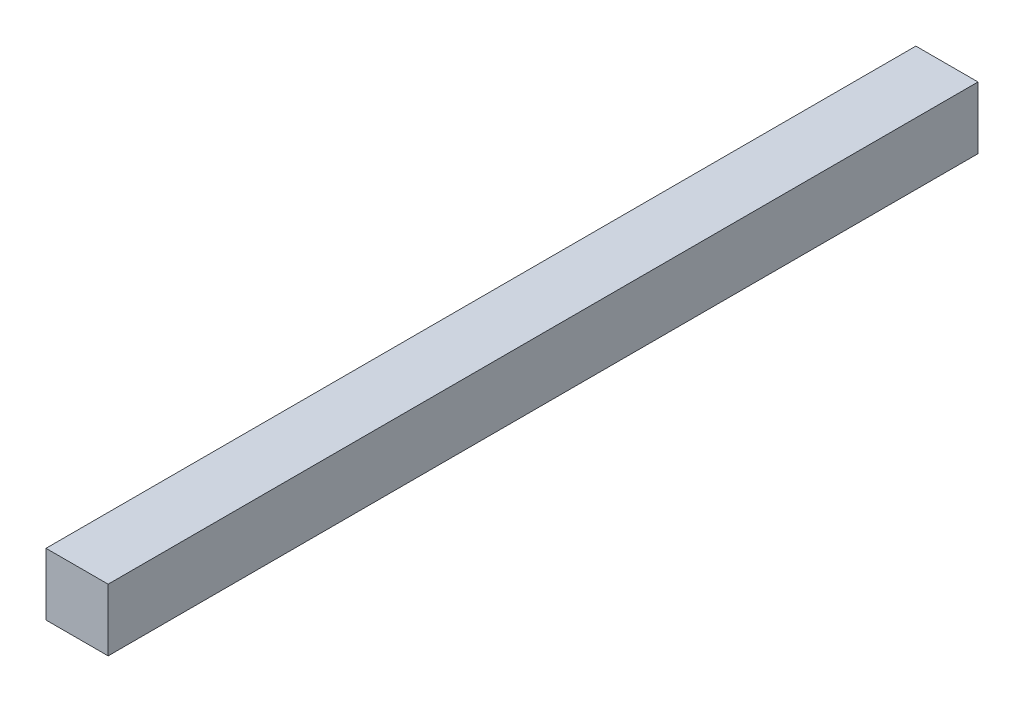
ISO-10303-21;
HEADER;
FILE_DESCRIPTION(('STEP AP214'),'2;1');
FILE_NAME('part.step','',(''),(''),'','','');
FILE_SCHEMA(('AUTOMOTIVE_DESIGN { 1 0 10303 214 1 1 1 1 }'));
ENDSEC;
DATA;
#1=APPLICATION_CONTEXT('core data for automotive mechanical design processes');
#2=APPLICATION_PROTOCOL_DEFINITION('international standard','automotive_design',2000,#1);
#3=PRODUCT_CONTEXT('',#1,'mechanical');
#4=PRODUCT('Part','Part','',(#3));
#5=PRODUCT_RELATED_PRODUCT_CATEGORY('part','',(#4));
#6=PRODUCT_DEFINITION_FORMATION('','',#4);
#7=PRODUCT_DEFINITION_CONTEXT('part definition',#1,'design');
#8=PRODUCT_DEFINITION('design','',#6,#7);
#9=PRODUCT_DEFINITION_SHAPE('','',#8);
#10=(LENGTH_UNIT() NAMED_UNIT(*) SI_UNIT(.MILLI.,.METRE.));
#11=(NAMED_UNIT(*) PLANE_ANGLE_UNIT() SI_UNIT($,.RADIAN.));
#12=(NAMED_UNIT(*) SI_UNIT($,.STERADIAN.) SOLID_ANGLE_UNIT());
#13=UNCERTAINTY_MEASURE_WITH_UNIT(LENGTH_MEASURE(1.E-05),#10,'distance_accuracy_value','');
#14=(GEOMETRIC_REPRESENTATION_CONTEXT(3) GLOBAL_UNCERTAINTY_ASSIGNED_CONTEXT((#13)) GLOBAL_UNIT_ASSIGNED_CONTEXT((#10,
#11,#12)) REPRESENTATION_CONTEXT('',''));
#15=CARTESIAN_POINT('',(0.,0.,0.));
#16=DIRECTION('',(0.,0.,1.));
#17=DIRECTION('',(1.,0.,0.));
#18=AXIS2_PLACEMENT_3D('',#15,#16,#17);
#19=CARTESIAN_POINT('',(-104.495777389633,34.1614287728547,140.));
#20=DIRECTION('',(1.,0.,0.));
#21=DIRECTION('',(0.,0.,-1.));
#22=AXIS2_PLACEMENT_3D('',#19,#20,#21);
#23=PLANE('',#22);
#24=DIRECTION('',(0.,-1.,0.));
#25=VECTOR('',#24,1.);
#26=CARTESIAN_POINT('',(-104.495777389633,34.1614287728547,0.));
#27=LINE('',#26,#25);
#28=CARTESIAN_POINT('',(-104.495777389633,34.1614287728547,0.));
#29=VERTEX_POINT('',#28);
#30=CARTESIAN_POINT('',(-104.495777389633,24.1614287728547,0.));
#31=VERTEX_POINT('',#30);
#32=EDGE_CURVE('E96',#29,#31,#27,.T.);
#33=ORIENTED_EDGE('',*,*,#32,.T.);
#34=DIRECTION('',(0.,0.,-1.));
#35=VECTOR('',#34,1.);
#36=CARTESIAN_POINT('',(-104.495777389633,24.1614287728547,140.));
#37=LINE('',#36,#35);
#38=CARTESIAN_POINT('',(-104.495777389633,24.1614287728547,140.));
#39=VERTEX_POINT('',#38);
#40=EDGE_CURVE('E11',#39,#31,#37,.T.);
#41=ORIENTED_EDGE('',*,*,#40,.F.);
#42=DIRECTION('',(0.,-1.,0.));
#43=VECTOR('',#42,1.);
#44=CARTESIAN_POINT('',(-104.495777389633,34.1614287728547,140.));
#45=LINE('',#44,#43);
#46=CARTESIAN_POINT('',(-104.495777389633,34.1614287728547,140.));
#47=VERTEX_POINT('',#46);
#48=EDGE_CURVE('E84',#47,#39,#45,.T.);
#49=ORIENTED_EDGE('',*,*,#48,.F.);
#50=DIRECTION('',(0.,0.,-1.));
#51=VECTOR('',#50,1.);
#52=CARTESIAN_POINT('',(-104.495777389633,34.1614287728547,140.));
#53=LINE('',#52,#51);
#54=EDGE_CURVE('E92',#47,#29,#53,.T.);
#55=ORIENTED_EDGE('',*,*,#54,.T.);
#56=EDGE_LOOP('',(#33,#41,#49,#55));
#57=FACE_BOUND('',#56,.T.);
#58=ADVANCED_FACE('F33',(#57),#23,.F.);
#59=CARTESIAN_POINT('',(-104.495777389633,24.1614287728547,140.));
#60=DIRECTION('',(0.,1.,0.));
#61=DIRECTION('',(0.,0.,1.));
#62=AXIS2_PLACEMENT_3D('',#59,#60,#61);
#63=PLANE('',#62);
#64=DIRECTION('',(1.,0.,0.));
#65=VECTOR('',#64,1.);
#66=CARTESIAN_POINT('',(-104.495777389633,24.1614287728547,0.));
#67=LINE('',#66,#65);
#68=CARTESIAN_POINT('',(-94.4957773896329,24.1614287728547,0.));
#69=VERTEX_POINT('',#68);
#70=EDGE_CURVE('E88',#31,#69,#67,.T.);
#71=ORIENTED_EDGE('',*,*,#70,.T.);
#72=DIRECTION('',(0.,0.,-1.));
#73=VECTOR('',#72,1.);
#74=CARTESIAN_POINT('',(-94.4957773896329,24.1614287728547,140.));
#75=LINE('',#74,#73);
#76=CARTESIAN_POINT('',(-94.4957773896329,24.1614287728547,140.));
#77=VERTEX_POINT('',#76);
#78=EDGE_CURVE('E41',#77,#69,#75,.T.);
#79=ORIENTED_EDGE('',*,*,#78,.F.);
#80=DIRECTION('',(1.,0.,0.));
#81=VECTOR('',#80,1.);
#82=CARTESIAN_POINT('',(-104.495777389633,24.1614287728547,140.));
#83=LINE('',#82,#81);
#84=EDGE_CURVE('E79',#39,#77,#83,.T.);
#85=ORIENTED_EDGE('',*,*,#84,.F.);
#86=ORIENTED_EDGE('',*,*,#40,.T.);
#87=EDGE_LOOP('',(#71,#79,#85,#86));
#88=FACE_BOUND('',#87,.T.);
#89=ADVANCED_FACE('F87',(#88),#63,.F.);
#90=CARTESIAN_POINT('',(-94.4957773896329,34.1614287728547,140.));
#91=DIRECTION('',(-1.,0.,0.));
#92=DIRECTION('',(0.,0.,1.));
#93=AXIS2_PLACEMENT_3D('',#90,#91,#92);
#94=PLANE('',#93);
#95=DIRECTION('',(0.,1.,0.));
#96=VECTOR('',#95,1.);
#97=CARTESIAN_POINT('',(-94.4957773896329,34.1614287728547,0.));
#98=LINE('',#97,#96);
#99=CARTESIAN_POINT('',(-94.4957773896329,34.1614287728547,0.));
#100=VERTEX_POINT('',#99);
#101=EDGE_CURVE('E66',#69,#100,#98,.T.);
#102=ORIENTED_EDGE('',*,*,#101,.T.);
#103=DIRECTION('',(0.,0.,-1.));
#104=VECTOR('',#103,1.);
#105=CARTESIAN_POINT('',(-94.4957773896329,34.1614287728547,140.));
#106=LINE('',#105,#104);
#107=CARTESIAN_POINT('',(-94.4957773896329,34.1614287728547,140.));
#108=VERTEX_POINT('',#107);
#109=EDGE_CURVE('E89',#108,#100,#106,.T.);
#110=ORIENTED_EDGE('',*,*,#109,.F.);
#111=DIRECTION('',(0.,1.,0.));
#112=VECTOR('',#111,1.);
#113=CARTESIAN_POINT('',(-94.4957773896329,34.1614287728547,140.));
#114=LINE('',#113,#112);
#115=EDGE_CURVE('E82',#77,#108,#114,.T.);
#116=ORIENTED_EDGE('',*,*,#115,.F.);
#117=ORIENTED_EDGE('',*,*,#78,.T.);
#118=EDGE_LOOP('',(#102,#110,#116,#117));
#119=FACE_BOUND('',#118,.T.);
#120=ADVANCED_FACE('F90',(#119),#94,.F.);
#121=CARTESIAN_POINT('',(-104.495777389633,34.1614287728547,140.));
#122=DIRECTION('',(0.,-1.,0.));
#123=DIRECTION('',(0.,0.,-1.));
#124=AXIS2_PLACEMENT_3D('',#121,#122,#123);
#125=PLANE('',#124);
#126=DIRECTION('',(-1.,0.,0.));
#127=VECTOR('',#126,1.);
#128=CARTESIAN_POINT('',(-104.495777389633,34.1614287728547,0.));
#129=LINE('',#128,#127);
#130=EDGE_CURVE('E72',#100,#29,#129,.T.);
#131=ORIENTED_EDGE('',*,*,#130,.T.);
#132=ORIENTED_EDGE('',*,*,#54,.F.);
#133=DIRECTION('',(-1.,0.,0.));
#134=VECTOR('',#133,1.);
#135=CARTESIAN_POINT('',(-104.495777389633,34.1614287728547,140.));
#136=LINE('',#135,#134);
#137=EDGE_CURVE('E49',#108,#47,#136,.T.);
#138=ORIENTED_EDGE('',*,*,#137,.F.);
#139=ORIENTED_EDGE('',*,*,#109,.T.);
#140=EDGE_LOOP('',(#131,#132,#138,#139));
#141=FACE_BOUND('',#140,.T.);
#142=ADVANCED_FACE('F103',(#141),#125,.F.);
#143=CARTESIAN_POINT('',(0.,0.,140.));
#144=DIRECTION('',(0.,0.,1.));
#145=DIRECTION('',(1.,0.,0.));
#146=AXIS2_PLACEMENT_3D('',#143,#144,#145);
#147=PLANE('',#146);
#148=ORIENTED_EDGE('',*,*,#48,.T.);
#149=ORIENTED_EDGE('',*,*,#84,.T.);
#150=ORIENTED_EDGE('',*,*,#115,.T.);
#151=ORIENTED_EDGE('',*,*,#137,.T.);
#152=EDGE_LOOP('',(#148,#149,#150,#151));
#153=FACE_BOUND('',#152,.T.);
#154=ADVANCED_FACE('F80',(#153),#147,.T.);
#155=CARTESIAN_POINT('',(0.,0.,0.));
#156=DIRECTION('',(0.,0.,1.));
#157=DIRECTION('',(1.,0.,0.));
#158=AXIS2_PLACEMENT_3D('',#155,#156,#157);
#159=PLANE('',#158);
#160=ORIENTED_EDGE('',*,*,#32,.F.);
#161=ORIENTED_EDGE('',*,*,#130,.F.);
#162=ORIENTED_EDGE('',*,*,#101,.F.);
#163=ORIENTED_EDGE('',*,*,#70,.F.);
#164=EDGE_LOOP('',(#160,#161,#162,#163));
#165=FACE_BOUND('',#164,.T.);
#166=ADVANCED_FACE('F106',(#165),#159,.F.);
#167=CLOSED_SHELL('',(#58,#89,#120,#142,#154,#166));
#168=MANIFOLD_SOLID_BREP('B2',#167);
#169=ADVANCED_BREP_SHAPE_REPRESENTATION('',(#18,#168),#14);
#170=SHAPE_DEFINITION_REPRESENTATION(#9,#169);
ENDSEC;
END-ISO-10303-21;
